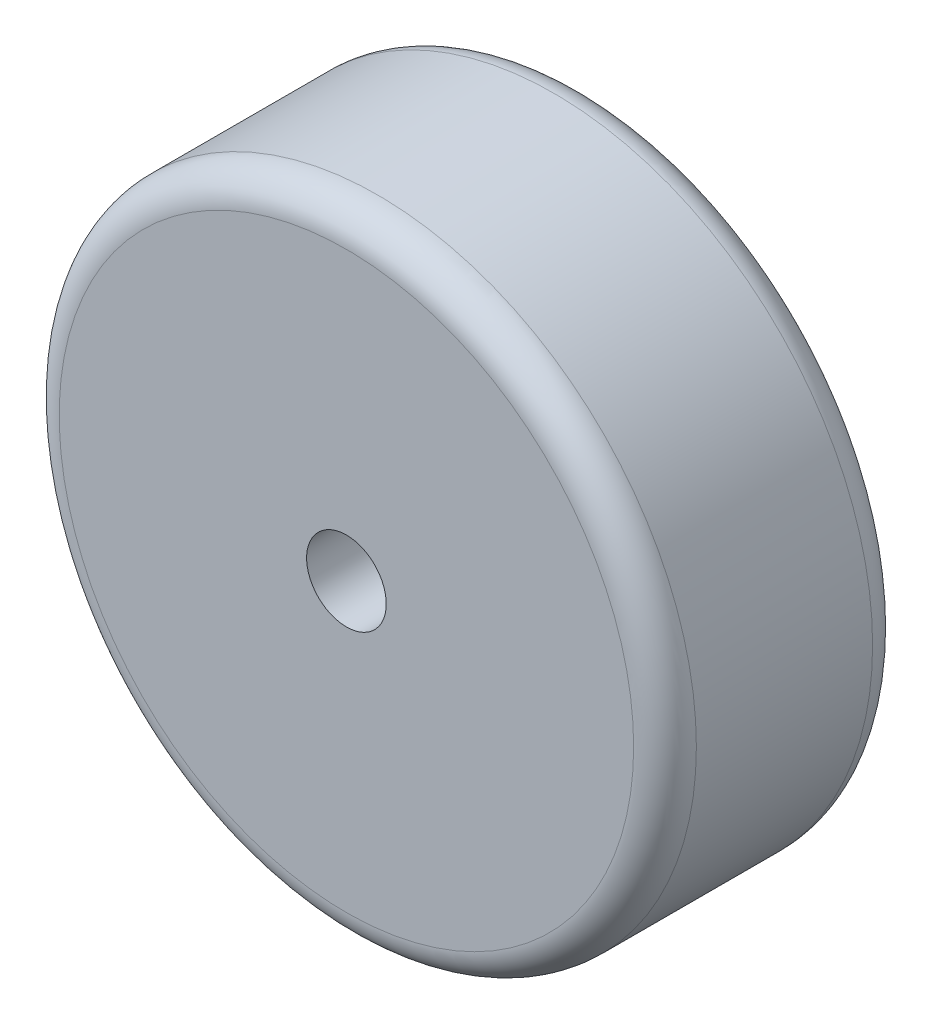
ISO-10303-21;
HEADER;
FILE_DESCRIPTION(('STEP AP214'),'2;1');
FILE_NAME('part.step','',(''),(''),'','','');
FILE_SCHEMA(('AUTOMOTIVE_DESIGN { 1 0 10303 214 1 1 1 1 }'));
ENDSEC;
DATA;
#1=APPLICATION_CONTEXT('core data for automotive mechanical design processes');
#2=APPLICATION_PROTOCOL_DEFINITION('international standard','automotive_design',2000,#1);
#3=PRODUCT_CONTEXT('',#1,'mechanical');
#4=PRODUCT('Part','Part','',(#3));
#5=PRODUCT_RELATED_PRODUCT_CATEGORY('part','',(#4));
#6=PRODUCT_DEFINITION_FORMATION('','',#4);
#7=PRODUCT_DEFINITION_CONTEXT('part definition',#1,'design');
#8=PRODUCT_DEFINITION('design','',#6,#7);
#9=PRODUCT_DEFINITION_SHAPE('','',#8);
#10=(LENGTH_UNIT() NAMED_UNIT(*) SI_UNIT(.MILLI.,.METRE.));
#11=(NAMED_UNIT(*) PLANE_ANGLE_UNIT() SI_UNIT($,.RADIAN.));
#12=(NAMED_UNIT(*) SI_UNIT($,.STERADIAN.) SOLID_ANGLE_UNIT());
#13=UNCERTAINTY_MEASURE_WITH_UNIT(LENGTH_MEASURE(1.E-05),#10,'distance_accuracy_value','');
#14=(GEOMETRIC_REPRESENTATION_CONTEXT(3) GLOBAL_UNCERTAINTY_ASSIGNED_CONTEXT((#13)) GLOBAL_UNIT_ASSIGNED_CONTEXT((#10,
#11,#12)) REPRESENTATION_CONTEXT('',''));
#15=CARTESIAN_POINT('',(0.,0.,0.));
#16=DIRECTION('',(0.,0.,1.));
#17=DIRECTION('',(1.,0.,0.));
#18=AXIS2_PLACEMENT_3D('',#15,#16,#17);
#19=CARTESIAN_POINT('',(0.,0.,38.1));
#20=DIRECTION('',(0.,0.,1.));
#21=DIRECTION('',(1.,0.,0.));
#22=AXIS2_PLACEMENT_3D('',#19,#20,#21);
#23=PLANE('',#22);
#24=CARTESIAN_POINT('',(0.,0.,38.1));
#25=DIRECTION('',(0.,0.,1.));
#26=DIRECTION('',(1.,0.,0.));
#27=AXIS2_PLACEMENT_3D('',#24,#25,#26);
#28=CIRCLE('',#27,91.6);
#29=CARTESIAN_POINT('',(91.6,0.,38.1));
#30=VERTEX_POINT('',#29);
#31=EDGE_CURVE('E49',#30,#30,#28,.T.);
#32=ORIENTED_EDGE('',*,*,#31,.T.);
#33=EDGE_LOOP('',(#32));
#34=FACE_BOUND('',#33,.T.);
#35=CARTESIAN_POINT('',(0.,0.,38.1));
#36=DIRECTION('',(0.,0.,1.));
#37=DIRECTION('',(1.,0.,0.));
#38=AXIS2_PLACEMENT_3D('',#35,#36,#37);
#39=CIRCLE('',#38,12.7);
#40=CARTESIAN_POINT('',(12.7,0.,38.1));
#41=VERTEX_POINT('',#40);
#42=EDGE_CURVE('E54',#41,#41,#39,.T.);
#43=ORIENTED_EDGE('',*,*,#42,.F.);
#44=EDGE_LOOP('',(#43));
#45=FACE_BOUND('',#44,.T.);
#46=ADVANCED_FACE('F34',(#34,#45),#23,.T.);
#47=CARTESIAN_POINT('',(0.,0.,-38.1));
#48=DIRECTION('',(0.,0.,1.));
#49=DIRECTION('',(1.,0.,0.));
#50=AXIS2_PLACEMENT_3D('',#47,#48,#49);
#51=PLANE('',#50);
#52=CARTESIAN_POINT('',(0.,0.,-38.1));
#53=DIRECTION('',(0.,0.,1.));
#54=DIRECTION('',(1.,0.,0.));
#55=AXIS2_PLACEMENT_3D('',#52,#53,#54);
#56=CIRCLE('',#55,91.6);
#57=CARTESIAN_POINT('',(91.6,0.,-38.1));
#58=VERTEX_POINT('',#57);
#59=EDGE_CURVE('E10',#58,#58,#56,.F.);
#60=ORIENTED_EDGE('',*,*,#59,.T.);
#61=EDGE_LOOP('',(#60));
#62=FACE_BOUND('',#61,.T.);
#63=CARTESIAN_POINT('',(0.,0.,-38.1));
#64=DIRECTION('',(0.,0.,1.));
#65=DIRECTION('',(1.,0.,0.));
#66=AXIS2_PLACEMENT_3D('',#63,#64,#65);
#67=CIRCLE('',#66,12.7);
#68=CARTESIAN_POINT('',(12.7,0.,-38.1));
#69=VERTEX_POINT('',#68);
#70=EDGE_CURVE('E55',#69,#69,#67,.T.);
#71=ORIENTED_EDGE('',*,*,#70,.T.);
#72=EDGE_LOOP('',(#71));
#73=FACE_BOUND('',#72,.T.);
#74=ADVANCED_FACE('F65',(#62,#73),#51,.F.);
#75=CARTESIAN_POINT('',(0.,0.,38.1));
#76=DIRECTION('',(0.,0.,-1.));
#77=DIRECTION('',(-1.,0.,0.));
#78=AXIS2_PLACEMENT_3D('',#75,#76,#77);
#79=CYLINDRICAL_SURFACE('',#78,101.6);
#80=CARTESIAN_POINT('',(0.,0.,28.1));
#81=DIRECTION('',(0.,0.,1.));
#82=DIRECTION('',(1.,0.,0.));
#83=AXIS2_PLACEMENT_3D('',#80,#81,#82);
#84=CIRCLE('',#83,101.6);
#85=CARTESIAN_POINT('',(101.6,0.,28.1));
#86=VERTEX_POINT('',#85);
#87=EDGE_CURVE('E41',#86,#86,#84,.F.);
#88=ORIENTED_EDGE('',*,*,#87,.T.);
#89=EDGE_LOOP('',(#88));
#90=FACE_BOUND('',#89,.T.);
#91=CARTESIAN_POINT('',(0.,0.,-28.1));
#92=DIRECTION('',(0.,0.,1.));
#93=DIRECTION('',(1.,0.,0.));
#94=AXIS2_PLACEMENT_3D('',#91,#92,#93);
#95=CIRCLE('',#94,101.6);
#96=CARTESIAN_POINT('',(101.6,0.,-28.1));
#97=VERTEX_POINT('',#96);
#98=EDGE_CURVE('E45',#97,#97,#95,.T.);
#99=ORIENTED_EDGE('',*,*,#98,.T.);
#100=EDGE_LOOP('',(#99));
#101=FACE_BOUND('',#100,.T.);
#102=ADVANCED_FACE('F71',(#90,#101),#79,.T.);
#103=CARTESIAN_POINT('',(0.,0.,38.1));
#104=DIRECTION('',(0.,0.,-1.));
#105=DIRECTION('',(-1.,0.,0.));
#106=AXIS2_PLACEMENT_3D('',#103,#104,#105);
#107=CYLINDRICAL_SURFACE('',#106,12.7);
#108=ORIENTED_EDGE('',*,*,#42,.T.);
#109=EDGE_LOOP('',(#108));
#110=FACE_BOUND('',#109,.T.);
#111=ORIENTED_EDGE('',*,*,#70,.F.);
#112=EDGE_LOOP('',(#111));
#113=FACE_BOUND('',#112,.T.);
#114=ADVANCED_FACE('F61',(#110,#113),#107,.F.);
#115=CARTESIAN_POINT('',(0.,0.,28.1));
#116=DIRECTION('',(0.,0.,1.));
#117=DIRECTION('',(1.,0.,0.));
#118=AXIS2_PLACEMENT_3D('',#115,#116,#117);
#119=TOROIDAL_SURFACE('',#118,91.6,10.);
#120=ORIENTED_EDGE('',*,*,#87,.F.);
#121=EDGE_LOOP('',(#120));
#122=FACE_BOUND('',#121,.T.);
#123=ORIENTED_EDGE('',*,*,#31,.F.);
#124=EDGE_LOOP('',(#123));
#125=FACE_BOUND('',#124,.T.);
#126=ADVANCED_FACE('F76',(#122,#125),#119,.T.);
#127=CARTESIAN_POINT('',(0.,0.,-28.1));
#128=DIRECTION('',(0.,0.,1.));
#129=DIRECTION('',(1.,0.,0.));
#130=AXIS2_PLACEMENT_3D('',#127,#128,#129);
#131=TOROIDAL_SURFACE('',#130,91.6,10.);
#132=ORIENTED_EDGE('',*,*,#59,.F.);
#133=EDGE_LOOP('',(#132));
#134=FACE_BOUND('',#133,.T.);
#135=ORIENTED_EDGE('',*,*,#98,.F.);
#136=EDGE_LOOP('',(#135));
#137=FACE_BOUND('',#136,.T.);
#138=ADVANCED_FACE('F36',(#134,#137),#131,.T.);
#139=CLOSED_SHELL('',(#46,#74,#102,#114,#126,#138));
#140=MANIFOLD_SOLID_BREP('B2',#139);
#141=ADVANCED_BREP_SHAPE_REPRESENTATION('',(#18,#140),#14);
#142=SHAPE_DEFINITION_REPRESENTATION(#9,#141);
ENDSEC;
END-ISO-10303-21;
